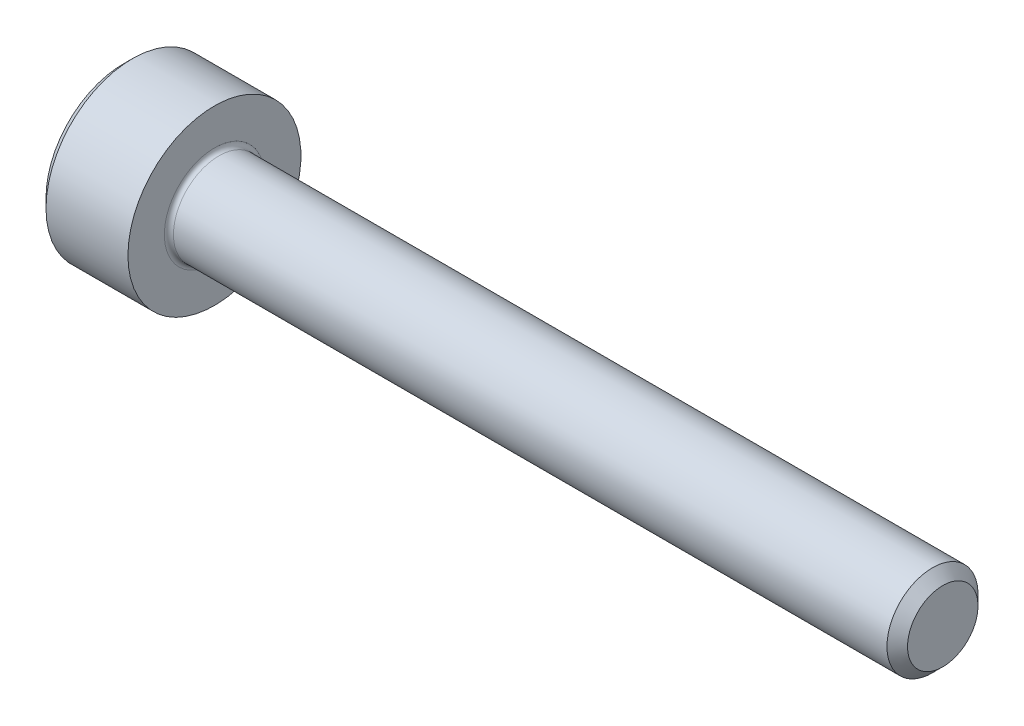
ISO-10303-21;
HEADER;
FILE_DESCRIPTION(('STEP AP214'),'2;1');
FILE_NAME('part.step','',(''),(''),'','','');
FILE_SCHEMA(('AUTOMOTIVE_DESIGN { 1 0 10303 214 1 1 1 1 }'));
ENDSEC;
DATA;
#1=APPLICATION_CONTEXT('core data for automotive mechanical design processes');
#2=APPLICATION_PROTOCOL_DEFINITION('international standard','automotive_design',2000,#1);
#3=PRODUCT_CONTEXT('',#1,'mechanical');
#4=PRODUCT('Part','Part','',(#3));
#5=PRODUCT_RELATED_PRODUCT_CATEGORY('part','',(#4));
#6=PRODUCT_DEFINITION_FORMATION('','',#4);
#7=PRODUCT_DEFINITION_CONTEXT('part definition',#1,'design');
#8=PRODUCT_DEFINITION('design','',#6,#7);
#9=PRODUCT_DEFINITION_SHAPE('','',#8);
#10=(LENGTH_UNIT() NAMED_UNIT(*) SI_UNIT(.MILLI.,.METRE.));
#11=(NAMED_UNIT(*) PLANE_ANGLE_UNIT() SI_UNIT($,.RADIAN.));
#12=(NAMED_UNIT(*) SI_UNIT($,.STERADIAN.) SOLID_ANGLE_UNIT());
#13=UNCERTAINTY_MEASURE_WITH_UNIT(LENGTH_MEASURE(1.E-05),#10,'distance_accuracy_value','');
#14=(GEOMETRIC_REPRESENTATION_CONTEXT(3) GLOBAL_UNCERTAINTY_ASSIGNED_CONTEXT((#13)) GLOBAL_UNIT_ASSIGNED_CONTEXT((#10,
#11,#12)) REPRESENTATION_CONTEXT('',''));
#15=CARTESIAN_POINT('',(0.,0.,0.));
#16=DIRECTION('',(0.,0.,1.));
#17=DIRECTION('',(1.,0.,0.));
#18=AXIS2_PLACEMENT_3D('',#15,#16,#17);
#19=CARTESIAN_POINT('',(0.,0.,0.));
#20=DIRECTION('',(-1.,0.,0.));
#21=DIRECTION('',(0.,0.,1.));
#22=AXIS2_PLACEMENT_3D('',#19,#20,#21);
#23=PLANE('',#22);
#24=DIRECTION('',(0.,-0.499999999999999,0.866025403784439));
#25=VECTOR('',#24,1.);
#26=CARTESIAN_POINT('',(0.,0.892006165897969,0.));
#27=LINE('',#26,#25);
#28=CARTESIAN_POINT('',(0.,0.892006165897969,0.));
#29=VERTEX_POINT('',#28);
#30=CARTESIAN_POINT('',(0.,0.446003082948984,0.772499999999997));
#31=VERTEX_POINT('',#30);
#32=EDGE_CURVE('E387',#29,#31,#27,.T.);
#33=ORIENTED_EDGE('',*,*,#32,.T.);
#34=DIRECTION('',(0.,1.,0.));
#35=VECTOR('',#34,1.);
#36=CARTESIAN_POINT('',(0.,-0.446003082948988,0.772499999999998));
#37=LINE('',#36,#35);
#38=CARTESIAN_POINT('',(0.,-0.446003082948988,0.772499999999998));
#39=VERTEX_POINT('',#38);
#40=EDGE_CURVE('E131',#39,#31,#37,.T.);
#41=ORIENTED_EDGE('',*,*,#40,.F.);
#42=DIRECTION('',(0.,-0.500000000000001,-0.866025403784438));
#43=VECTOR('',#42,1.);
#44=CARTESIAN_POINT('',(0.,-0.446003082948988,0.772499999999998));
#45=LINE('',#44,#43);
#46=CARTESIAN_POINT('',(0.,-0.892006165897975,0.));
#47=VERTEX_POINT('',#46);
#48=EDGE_CURVE('E390',#39,#47,#45,.T.);
#49=ORIENTED_EDGE('',*,*,#48,.T.);
#50=DIRECTION('',(0.,0.499999999999999,-0.866025403784439));
#51=VECTOR('',#50,1.);
#52=CARTESIAN_POINT('',(0.,-0.892006165897975,0.));
#53=LINE('',#52,#51);
#54=CARTESIAN_POINT('',(0.,-0.44600308294899,-0.772500000000002));
#55=VERTEX_POINT('',#54);
#56=EDGE_CURVE('E393',#47,#55,#53,.T.);
#57=ORIENTED_EDGE('',*,*,#56,.T.);
#58=DIRECTION('',(0.,-1.,0.));
#59=VECTOR('',#58,1.);
#60=CARTESIAN_POINT('',(0.,0.446003082948982,-0.772500000000003));
#61=LINE('',#60,#59);
#62=CARTESIAN_POINT('',(0.,0.446003082948982,-0.772500000000003));
#63=VERTEX_POINT('',#62);
#64=EDGE_CURVE('E396',#63,#55,#61,.T.);
#65=ORIENTED_EDGE('',*,*,#64,.F.);
#66=DIRECTION('',(0.,-0.500000000000001,-0.866025403784438));
#67=VECTOR('',#66,1.);
#68=CARTESIAN_POINT('',(0.,0.892006165897969,0.));
#69=LINE('',#68,#67);
#70=EDGE_CURVE('E126',#29,#63,#69,.T.);
#71=ORIENTED_EDGE('',*,*,#70,.F.);
#72=EDGE_LOOP('',(#33,#41,#49,#57,#65,#71));
#73=FACE_BOUND('',#72,.T.);
#74=CARTESIAN_POINT('',(0.,0.,0.));
#75=DIRECTION('',(-1.,0.,0.));
#76=DIRECTION('',(0.,0.,1.));
#77=AXIS2_PLACEMENT_3D('',#74,#75,#76);
#78=CIRCLE('',#77,1.7);
#79=CARTESIAN_POINT('',(0.,0.,1.7));
#80=VERTEX_POINT('',#79);
#81=EDGE_CURVE('E142',#80,#80,#78,.T.);
#82=ORIENTED_EDGE('',*,*,#81,.T.);
#83=EDGE_LOOP('',(#82));
#84=FACE_BOUND('',#83,.T.);
#85=ADVANCED_FACE('F35',(#73,#84),#23,.T.);
#86=CARTESIAN_POINT('',(18.,0.774,0.));
#87=DIRECTION('',(1.,0.,0.));
#88=DIRECTION('',(0.,0.,-1.));
#89=AXIS2_PLACEMENT_3D('',#86,#87,#88);
#90=PLANE('',#89);
#91=CARTESIAN_POINT('',(18.,0.,0.));
#92=DIRECTION('',(-1.,0.,0.));
#93=DIRECTION('',(0.,0.,1.));
#94=AXIS2_PLACEMENT_3D('',#91,#92,#93);
#95=CIRCLE('',#94,0.774);
#96=CARTESIAN_POINT('',(18.,0.,0.774));
#97=VERTEX_POINT('',#96);
#98=EDGE_CURVE('E155',#97,#97,#95,.T.);
#99=ORIENTED_EDGE('',*,*,#98,.F.);
#100=EDGE_LOOP('',(#99));
#101=FACE_BOUND('',#100,.T.);
#102=ADVANCED_FACE('F176',(#101),#90,.T.);
#103=CARTESIAN_POINT('',(18.,0.,0.));
#104=DIRECTION('',(-1.,0.,0.));
#105=DIRECTION('',(0.,0.,1.));
#106=AXIS2_PLACEMENT_3D('',#103,#104,#105);
#107=CONICAL_SURFACE('',#106,0.774,0.785398163397343);
#108=CARTESIAN_POINT('',(17.774,0.,0.));
#109=DIRECTION('',(-1.,0.,0.));
#110=DIRECTION('',(0.,0.,1.));
#111=AXIS2_PLACEMENT_3D('',#108,#109,#110);
#112=CIRCLE('',#111,0.999999999999971);
#113=CARTESIAN_POINT('',(17.774,0.,0.999999999999971));
#114=VERTEX_POINT('',#113);
#115=EDGE_CURVE('E152',#114,#114,#112,.T.);
#116=ORIENTED_EDGE('',*,*,#115,.F.);
#117=EDGE_LOOP('',(#116));
#118=FACE_BOUND('',#117,.T.);
#119=ORIENTED_EDGE('',*,*,#98,.T.);
#120=EDGE_LOOP('',(#119));
#121=FACE_BOUND('',#120,.T.);
#122=ADVANCED_FACE('F182',(#118,#121),#107,.T.);
#123=CARTESIAN_POINT('',(-31.75,0.,0.));
#124=DIRECTION('',(-1.,0.,0.));
#125=DIRECTION('',(0.,0.,1.));
#126=AXIS2_PLACEMENT_3D('',#123,#124,#125);
#127=CYLINDRICAL_SURFACE('',#126,0.999999999999986);
#128=CARTESIAN_POINT('',(2.1,0.,0.));
#129=DIRECTION('',(1.,0.,0.));
#130=DIRECTION('',(0.,0.,-1.));
#131=AXIS2_PLACEMENT_3D('',#128,#129,#130);
#132=CIRCLE('',#131,0.999999999999986);
#133=CARTESIAN_POINT('',(2.1,0.,-0.999999999999986));
#134=VERTEX_POINT('',#133);
#135=EDGE_CURVE('E11',#134,#134,#132,.T.);
#136=ORIENTED_EDGE('',*,*,#135,.T.);
#137=EDGE_LOOP('',(#136));
#138=FACE_BOUND('',#137,.T.);
#139=ORIENTED_EDGE('',*,*,#115,.T.);
#140=EDGE_LOOP('',(#139));
#141=FACE_BOUND('',#140,.T.);
#142=ADVANCED_FACE('F193',(#138,#141),#127,.T.);
#143=CARTESIAN_POINT('',(2.,1.9,0.));
#144=DIRECTION('',(1.,0.,0.));
#145=DIRECTION('',(0.,0.,-1.));
#146=AXIS2_PLACEMENT_3D('',#143,#144,#145);
#147=PLANE('',#146);
#148=CARTESIAN_POINT('',(2.,0.,0.));
#149=DIRECTION('',(1.,0.,0.));
#150=DIRECTION('',(0.,0.,-1.));
#151=AXIS2_PLACEMENT_3D('',#148,#149,#150);
#152=CIRCLE('',#151,1.09999999999999);
#153=CARTESIAN_POINT('',(2.,0.,-1.09999999999999));
#154=VERTEX_POINT('',#153);
#155=EDGE_CURVE('E43',#154,#154,#152,.F.);
#156=ORIENTED_EDGE('',*,*,#155,.T.);
#157=EDGE_LOOP('',(#156));
#158=FACE_BOUND('',#157,.T.);
#159=CARTESIAN_POINT('',(2.,0.,0.));
#160=DIRECTION('',(-1.,0.,0.));
#161=DIRECTION('',(0.,0.,1.));
#162=AXIS2_PLACEMENT_3D('',#159,#160,#161);
#163=CIRCLE('',#162,1.9);
#164=CARTESIAN_POINT('',(2.,0.,1.9));
#165=VERTEX_POINT('',#164);
#166=EDGE_CURVE('E149',#165,#165,#163,.T.);
#167=ORIENTED_EDGE('',*,*,#166,.F.);
#168=EDGE_LOOP('',(#167));
#169=FACE_BOUND('',#168,.T.);
#170=ADVANCED_FACE('F160',(#158,#169),#147,.T.);
#171=CARTESIAN_POINT('',(-31.75,0.,0.));
#172=DIRECTION('',(-1.,0.,0.));
#173=DIRECTION('',(0.,0.,1.));
#174=AXIS2_PLACEMENT_3D('',#171,#172,#173);
#175=CYLINDRICAL_SURFACE('',#174,1.9);
#176=ORIENTED_EDGE('',*,*,#166,.T.);
#177=EDGE_LOOP('',(#176));
#178=FACE_BOUND('',#177,.T.);
#179=CARTESIAN_POINT('',(0.199999999999999,0.,0.));
#180=DIRECTION('',(-1.,0.,0.));
#181=DIRECTION('',(0.,0.,1.));
#182=AXIS2_PLACEMENT_3D('',#179,#180,#181);
#183=CIRCLE('',#182,1.9);
#184=CARTESIAN_POINT('',(0.199999999999999,0.,1.9));
#185=VERTEX_POINT('',#184);
#186=EDGE_CURVE('E146',#185,#185,#183,.T.);
#187=ORIENTED_EDGE('',*,*,#186,.F.);
#188=EDGE_LOOP('',(#187));
#189=FACE_BOUND('',#188,.T.);
#190=ADVANCED_FACE('F171',(#178,#189),#175,.T.);
#191=CARTESIAN_POINT('',(0.,0.,0.));
#192=DIRECTION('',(1.,0.,0.));
#193=DIRECTION('',(0.,0.,-1.));
#194=AXIS2_PLACEMENT_3D('',#191,#192,#193);
#195=CONICAL_SURFACE('',#194,1.7,0.785398163397449);
#196=ORIENTED_EDGE('',*,*,#186,.T.);
#197=EDGE_LOOP('',(#196));
#198=FACE_BOUND('',#197,.T.);
#199=ORIENTED_EDGE('',*,*,#81,.F.);
#200=EDGE_LOOP('',(#199));
#201=FACE_BOUND('',#200,.T.);
#202=ADVANCED_FACE('F164',(#198,#201),#195,.T.);
#203=CARTESIAN_POINT('',(2.1,0.,0.));
#204=DIRECTION('',(1.,0.,0.));
#205=DIRECTION('',(0.,0.,-1.));
#206=AXIS2_PLACEMENT_3D('',#203,#204,#205);
#207=TOROIDAL_SURFACE('',#206,1.09999999999999,0.1);
#208=ORIENTED_EDGE('',*,*,#135,.F.);
#209=EDGE_LOOP('',(#208));
#210=FACE_BOUND('',#209,.T.);
#211=ORIENTED_EDGE('',*,*,#155,.F.);
#212=EDGE_LOOP('',(#211));
#213=FACE_BOUND('',#212,.T.);
#214=ADVANCED_FACE('F37',(#210,#213),#207,.F.);
#215=CARTESIAN_POINT('',(1.,0.892006165897969,0.));
#216=DIRECTION('',(0.,-0.866025403784439,-0.499999999999999));
#217=DIRECTION('',(0.,0.499999999999999,-0.866025403784439));
#218=AXIS2_PLACEMENT_3D('',#215,#216,#217);
#219=PLANE('',#218);
#220=ORIENTED_EDGE('',*,*,#32,.F.);
#221=DIRECTION('',(-1.,0.,0.));
#222=VECTOR('',#221,1.);
#223=CARTESIAN_POINT('',(1.,0.892006165897969,0.));
#224=LINE('',#223,#222);
#225=CARTESIAN_POINT('',(1.,0.892006165897969,0.));
#226=VERTEX_POINT('',#225);
#227=EDGE_CURVE('E377',#226,#29,#224,.T.);
#228=ORIENTED_EDGE('',*,*,#227,.F.);
#229=DIRECTION('',(0.,-0.499999999999999,0.866025403784439));
#230=VECTOR('',#229,1.);
#231=CARTESIAN_POINT('',(1.,0.892006165897969,0.));
#232=LINE('',#231,#230);
#233=CARTESIAN_POINT('',(1.,0.669004624423476,0.386249999999997));
#234=VERTEX_POINT('',#233);
#235=EDGE_CURVE('E118',#226,#234,#232,.T.);
#236=ORIENTED_EDGE('',*,*,#235,.T.);
#237=CARTESIAN_POINT('',(1.,0.446003082948984,0.772499999999997));
#238=VERTEX_POINT('',#237);
#239=EDGE_CURVE('E109',#234,#238,#232,.T.);
#240=ORIENTED_EDGE('',*,*,#239,.T.);
#241=DIRECTION('',(-1.,0.,0.));
#242=VECTOR('',#241,1.);
#243=CARTESIAN_POINT('',(1.,0.446003082948984,0.772499999999997));
#244=LINE('',#243,#242);
#245=EDGE_CURVE('E123',#238,#31,#244,.T.);
#246=ORIENTED_EDGE('',*,*,#245,.T.);
#247=EDGE_LOOP('',(#220,#228,#236,#240,#246));
#248=FACE_BOUND('',#247,.T.);
#249=ADVANCED_FACE('F122',(#248),#219,.T.);
#250=CARTESIAN_POINT('',(1.,-0.446003082948988,0.772499999999998));
#251=DIRECTION('',(0.,0.,1.));
#252=DIRECTION('',(0.,-1.,0.));
#253=AXIS2_PLACEMENT_3D('',#250,#251,#252);
#254=PLANE('',#253);
#255=ORIENTED_EDGE('',*,*,#40,.T.);
#256=ORIENTED_EDGE('',*,*,#245,.F.);
#257=DIRECTION('',(0.,1.,0.));
#258=VECTOR('',#257,1.);
#259=CARTESIAN_POINT('',(1.,-0.446003082948988,0.772499999999998));
#260=LINE('',#259,#258);
#261=CARTESIAN_POINT('',(1.,0.,0.772499999999998));
#262=VERTEX_POINT('',#261);
#263=EDGE_CURVE('E106',#262,#238,#260,.T.);
#264=ORIENTED_EDGE('',*,*,#263,.F.);
#265=CARTESIAN_POINT('',(1.,-0.446003082948988,0.772499999999998));
#266=VERTEX_POINT('',#265);
#267=EDGE_CURVE('E117',#266,#262,#260,.T.);
#268=ORIENTED_EDGE('',*,*,#267,.F.);
#269=DIRECTION('',(-1.,0.,0.));
#270=VECTOR('',#269,1.);
#271=CARTESIAN_POINT('',(1.,-0.446003082948988,0.772499999999998));
#272=LINE('',#271,#270);
#273=EDGE_CURVE('E133',#266,#39,#272,.T.);
#274=ORIENTED_EDGE('',*,*,#273,.T.);
#275=EDGE_LOOP('',(#255,#256,#264,#268,#274));
#276=FACE_BOUND('',#275,.T.);
#277=ADVANCED_FACE('F128',(#276),#254,.F.);
#278=CARTESIAN_POINT('',(1.,-0.446003082948988,0.772499999999998));
#279=DIRECTION('',(0.,0.866025403784438,-0.500000000000001));
#280=DIRECTION('',(0.,0.500000000000001,0.866025403784438));
#281=AXIS2_PLACEMENT_3D('',#278,#279,#280);
#282=PLANE('',#281);
#283=ORIENTED_EDGE('',*,*,#48,.F.);
#284=ORIENTED_EDGE('',*,*,#273,.F.);
#285=DIRECTION('',(0.,-0.500000000000001,-0.866025403784438));
#286=VECTOR('',#285,1.);
#287=CARTESIAN_POINT('',(1.,-0.446003082948988,0.772499999999998));
#288=LINE('',#287,#286);
#289=CARTESIAN_POINT('',(1.,-0.66900462442348,0.386250000000001));
#290=VERTEX_POINT('',#289);
#291=EDGE_CURVE('E416',#266,#290,#288,.T.);
#292=ORIENTED_EDGE('',*,*,#291,.T.);
#293=CARTESIAN_POINT('',(1.,-0.892006165897975,0.));
#294=VERTEX_POINT('',#293);
#295=EDGE_CURVE('E405',#290,#294,#288,.T.);
#296=ORIENTED_EDGE('',*,*,#295,.T.);
#297=DIRECTION('',(-1.,0.,0.));
#298=VECTOR('',#297,1.);
#299=CARTESIAN_POINT('',(1.,-0.892006165897975,0.));
#300=LINE('',#299,#298);
#301=EDGE_CURVE('E138',#294,#47,#300,.T.);
#302=ORIENTED_EDGE('',*,*,#301,.T.);
#303=EDGE_LOOP('',(#283,#284,#292,#296,#302));
#304=FACE_BOUND('',#303,.T.);
#305=ADVANCED_FACE('F268',(#304),#282,.T.);
#306=CARTESIAN_POINT('',(1.,-0.892006165897975,0.));
#307=DIRECTION('',(0.,0.866025403784439,0.499999999999999));
#308=DIRECTION('',(0.,-0.499999999999999,0.866025403784439));
#309=AXIS2_PLACEMENT_3D('',#306,#307,#308);
#310=PLANE('',#309);
#311=ORIENTED_EDGE('',*,*,#56,.F.);
#312=ORIENTED_EDGE('',*,*,#301,.F.);
#313=DIRECTION('',(0.,0.499999999999999,-0.866025403784439));
#314=VECTOR('',#313,1.);
#315=CARTESIAN_POINT('',(1.,-0.892006165897975,0.));
#316=LINE('',#315,#314);
#317=CARTESIAN_POINT('',(1.,-0.669004624423483,-0.386250000000001));
#318=VERTEX_POINT('',#317);
#319=EDGE_CURVE('E383',#294,#318,#316,.T.);
#320=ORIENTED_EDGE('',*,*,#319,.T.);
#321=CARTESIAN_POINT('',(1.,-0.44600308294899,-0.772500000000002));
#322=VERTEX_POINT('',#321);
#323=EDGE_CURVE('E415',#318,#322,#316,.T.);
#324=ORIENTED_EDGE('',*,*,#323,.T.);
#325=DIRECTION('',(-1.,0.,0.));
#326=VECTOR('',#325,1.);
#327=CARTESIAN_POINT('',(1.,-0.44600308294899,-0.772500000000002));
#328=LINE('',#327,#326);
#329=EDGE_CURVE('E376',#322,#55,#328,.T.);
#330=ORIENTED_EDGE('',*,*,#329,.T.);
#331=EDGE_LOOP('',(#311,#312,#320,#324,#330));
#332=FACE_BOUND('',#331,.T.);
#333=ADVANCED_FACE('F276',(#332),#310,.T.);
#334=CARTESIAN_POINT('',(1.,0.446003082948982,-0.772500000000003));
#335=DIRECTION('',(0.,0.,-1.));
#336=DIRECTION('',(0.,1.,0.));
#337=AXIS2_PLACEMENT_3D('',#334,#335,#336);
#338=PLANE('',#337);
#339=ORIENTED_EDGE('',*,*,#64,.T.);
#340=ORIENTED_EDGE('',*,*,#329,.F.);
#341=DIRECTION('',(0.,-1.,0.));
#342=VECTOR('',#341,1.);
#343=CARTESIAN_POINT('',(1.,0.446003082948982,-0.772500000000003));
#344=LINE('',#343,#342);
#345=CARTESIAN_POINT('',(1.,0.,-0.7725));
#346=VERTEX_POINT('',#345);
#347=EDGE_CURVE('E380',#346,#322,#344,.T.);
#348=ORIENTED_EDGE('',*,*,#347,.F.);
#349=CARTESIAN_POINT('',(1.,0.446003082948982,-0.772500000000003));
#350=VERTEX_POINT('',#349);
#351=EDGE_CURVE('E50',#350,#346,#344,.T.);
#352=ORIENTED_EDGE('',*,*,#351,.F.);
#353=DIRECTION('',(-1.,0.,0.));
#354=VECTOR('',#353,1.);
#355=CARTESIAN_POINT('',(1.,0.446003082948982,-0.772500000000003));
#356=LINE('',#355,#354);
#357=EDGE_CURVE('E373',#350,#63,#356,.T.);
#358=ORIENTED_EDGE('',*,*,#357,.T.);
#359=EDGE_LOOP('',(#339,#340,#348,#352,#358));
#360=FACE_BOUND('',#359,.T.);
#361=ADVANCED_FACE('F285',(#360),#338,.F.);
#362=CARTESIAN_POINT('',(1.,0.892006165897969,0.));
#363=DIRECTION('',(0.,0.866025403784438,-0.500000000000001));
#364=DIRECTION('',(0.,0.500000000000001,0.866025403784438));
#365=AXIS2_PLACEMENT_3D('',#362,#363,#364);
#366=PLANE('',#365);
#367=ORIENTED_EDGE('',*,*,#70,.T.);
#368=ORIENTED_EDGE('',*,*,#357,.F.);
#369=DIRECTION('',(0.,-0.500000000000001,-0.866025403784438));
#370=VECTOR('',#369,1.);
#371=CARTESIAN_POINT('',(1.,0.892006165897969,0.));
#372=LINE('',#371,#370);
#373=CARTESIAN_POINT('',(1.,0.669004624423477,-0.38625));
#374=VERTEX_POINT('',#373);
#375=EDGE_CURVE('E363',#374,#350,#372,.T.);
#376=ORIENTED_EDGE('',*,*,#375,.F.);
#377=EDGE_CURVE('E369',#226,#374,#372,.T.);
#378=ORIENTED_EDGE('',*,*,#377,.F.);
#379=ORIENTED_EDGE('',*,*,#227,.T.);
#380=EDGE_LOOP('',(#367,#368,#376,#378,#379));
#381=FACE_BOUND('',#380,.T.);
#382=ADVANCED_FACE('F294',(#381),#366,.F.);
#383=CARTESIAN_POINT('',(1.,1.33800924884695,-0.772500000000004));
#384=DIRECTION('',(1.,0.,0.));
#385=DIRECTION('',(0.,0.,-1.));
#386=AXIS2_PLACEMENT_3D('',#383,#384,#385);
#387=PLANE('',#386);
#388=ORIENTED_EDGE('',*,*,#347,.T.);
#389=ORIENTED_EDGE('',*,*,#323,.F.);
#390=CARTESIAN_POINT('',(1.,0.,0.));
#391=DIRECTION('',(-1.,0.,0.));
#392=DIRECTION('',(0.,0.,1.));
#393=AXIS2_PLACEMENT_3D('',#390,#391,#392);
#394=CIRCLE('',#393,0.7725);
#395=EDGE_CURVE('E411',#346,#318,#394,.T.);
#396=ORIENTED_EDGE('',*,*,#395,.F.);
#397=EDGE_LOOP('',(#388,#389,#396));
#398=FACE_BOUND('',#397,.T.);
#399=ADVANCED_FACE('F303',(#398),#387,.F.);
#400=ORIENTED_EDGE('',*,*,#319,.F.);
#401=ORIENTED_EDGE('',*,*,#295,.F.);
#402=EDGE_CURVE('E136',#318,#290,#394,.T.);
#403=ORIENTED_EDGE('',*,*,#402,.F.);
#404=EDGE_LOOP('',(#400,#401,#403));
#405=FACE_BOUND('',#404,.T.);
#406=ADVANCED_FACE('F312',(#405),#387,.F.);
#407=ORIENTED_EDGE('',*,*,#291,.F.);
#408=ORIENTED_EDGE('',*,*,#267,.T.);
#409=EDGE_CURVE('E132',#290,#262,#394,.T.);
#410=ORIENTED_EDGE('',*,*,#409,.F.);
#411=EDGE_LOOP('',(#407,#408,#410));
#412=FACE_BOUND('',#411,.T.);
#413=ADVANCED_FACE('F321',(#412),#387,.F.);
#414=ORIENTED_EDGE('',*,*,#263,.T.);
#415=ORIENTED_EDGE('',*,*,#239,.F.);
#416=EDGE_CURVE('E112',#262,#234,#394,.T.);
#417=ORIENTED_EDGE('',*,*,#416,.F.);
#418=EDGE_LOOP('',(#414,#415,#417));
#419=FACE_BOUND('',#418,.T.);
#420=ADVANCED_FACE('F108',(#419),#387,.F.);
#421=ORIENTED_EDGE('',*,*,#235,.F.);
#422=ORIENTED_EDGE('',*,*,#377,.T.);
#423=EDGE_CURVE('E143',#234,#374,#394,.T.);
#424=ORIENTED_EDGE('',*,*,#423,.F.);
#425=EDGE_LOOP('',(#421,#422,#424));
#426=FACE_BOUND('',#425,.T.);
#427=ADVANCED_FACE('F336',(#426),#387,.F.);
#428=ORIENTED_EDGE('',*,*,#375,.T.);
#429=ORIENTED_EDGE('',*,*,#351,.T.);
#430=EDGE_CURVE('E366',#374,#346,#394,.T.);
#431=ORIENTED_EDGE('',*,*,#430,.F.);
#432=EDGE_LOOP('',(#428,#429,#431));
#433=FACE_BOUND('',#432,.T.);
#434=ADVANCED_FACE('F251',(#433),#387,.F.);
#435=CARTESIAN_POINT('',(1.,0.,0.));
#436=DIRECTION('',(-1.,0.,0.));
#437=DIRECTION('',(0.,0.,1.));
#438=AXIS2_PLACEMENT_3D('',#435,#436,#437);
#439=CONICAL_SURFACE('',#438,0.7725,1.04719755119659);
#440=CARTESIAN_POINT('',(1.446003082949,0.,0.));
#441=VERTEX_POINT('',#440);
#442=VERTEX_LOOP('',#441);
#443=FACE_BOUND('',#442,.T.);
#444=ORIENTED_EDGE('',*,*,#416,.T.);
#445=ORIENTED_EDGE('',*,*,#423,.T.);
#446=ORIENTED_EDGE('',*,*,#430,.T.);
#447=ORIENTED_EDGE('',*,*,#395,.T.);
#448=ORIENTED_EDGE('',*,*,#402,.T.);
#449=ORIENTED_EDGE('',*,*,#409,.T.);
#450=EDGE_LOOP('',(#444,#445,#446,#447,#448,#449));
#451=FACE_BOUND('',#450,.T.);
#452=ADVANCED_FACE('F186',(#443,#451),#439,.F.);
#453=CLOSED_SHELL('',(#85,#102,#122,#142,#170,#190,#202,#214,#249,#277,#305,#333,#361,#382,#399,
#406,#413,#420,#427,#434,#452));
#454=MANIFOLD_SOLID_BREP('B2',#453);
#455=ADVANCED_BREP_SHAPE_REPRESENTATION('',(#18,#454),#14);
#456=SHAPE_DEFINITION_REPRESENTATION(#9,#455);
ENDSEC;
END-ISO-10303-21;
